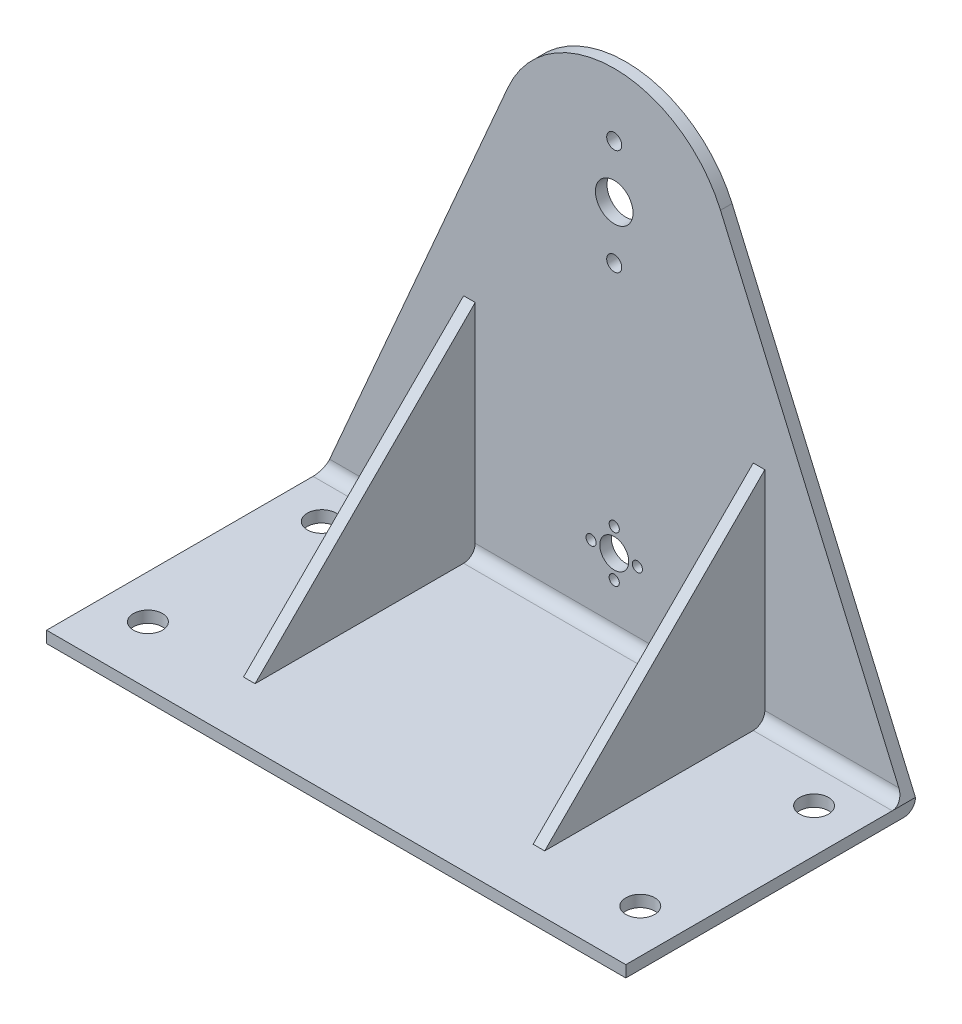
ISO-10303-21;
HEADER;
FILE_DESCRIPTION(('STEP AP214'),'2;1');
FILE_NAME('part.step','',(''),(''),'','','');
FILE_SCHEMA(('AUTOMOTIVE_DESIGN { 1 0 10303 214 1 1 1 1 }'));
ENDSEC;
DATA;
#1=APPLICATION_CONTEXT('core data for automotive mechanical design processes');
#2=APPLICATION_PROTOCOL_DEFINITION('international standard','automotive_design',2000,#1);
#3=PRODUCT_CONTEXT('',#1,'mechanical');
#4=PRODUCT('Part','Part','',(#3));
#5=PRODUCT_RELATED_PRODUCT_CATEGORY('part','',(#4));
#6=PRODUCT_DEFINITION_FORMATION('','',#4);
#7=PRODUCT_DEFINITION_CONTEXT('part definition',#1,'design');
#8=PRODUCT_DEFINITION('design','',#6,#7);
#9=PRODUCT_DEFINITION_SHAPE('','',#8);
#10=(LENGTH_UNIT() NAMED_UNIT(*) SI_UNIT(.MILLI.,.METRE.));
#11=(NAMED_UNIT(*) PLANE_ANGLE_UNIT() SI_UNIT($,.RADIAN.));
#12=(NAMED_UNIT(*) SI_UNIT($,.STERADIAN.) SOLID_ANGLE_UNIT());
#13=UNCERTAINTY_MEASURE_WITH_UNIT(LENGTH_MEASURE(1.E-05),#10,'distance_accuracy_value','');
#14=(GEOMETRIC_REPRESENTATION_CONTEXT(3) GLOBAL_UNCERTAINTY_ASSIGNED_CONTEXT((#13)) GLOBAL_UNIT_ASSIGNED_CONTEXT((#10,
#11,#12)) REPRESENTATION_CONTEXT('',''));
#15=CARTESIAN_POINT('',(0.,0.,0.));
#16=DIRECTION('',(0.,0.,1.));
#17=DIRECTION('',(1.,0.,0.));
#18=AXIS2_PLACEMENT_3D('',#15,#16,#17);
#19=CARTESIAN_POINT('',(100.,4.,8.00000000000001));
#20=DIRECTION('',(1.,0.,0.));
#21=DIRECTION('',(0.,0.,-1.));
#22=AXIS2_PLACEMENT_3D('',#19,#20,#21);
#23=CYLINDRICAL_SURFACE('',#22,4.);
#24=CARTESIAN_POINT('',(48.,4.,8.00000000000001));
#25=DIRECTION('',(1.,0.,0.));
#26=DIRECTION('',(0.,0.,-1.));
#27=AXIS2_PLACEMENT_3D('',#24,#25,#26);
#28=CIRCLE('',#27,4.);
#29=CARTESIAN_POINT('',(48.,4.,4.00000000000001));
#30=VERTEX_POINT('',#29);
#31=CARTESIAN_POINT('',(48.,0.,8.00000000000001));
#32=VERTEX_POINT('',#31);
#33=EDGE_CURVE('E59',#30,#32,#28,.F.);
#34=ORIENTED_EDGE('',*,*,#33,.F.);
#35=DIRECTION('',(-1.,0.,0.));
#36=VECTOR('',#35,1.);
#37=CARTESIAN_POINT('',(100.,4.,4.));
#38=LINE('',#37,#36);
#39=CARTESIAN_POINT('',(-48.,3.99999999999999,4.00000000000001));
#40=VERTEX_POINT('',#39);
#41=EDGE_CURVE('E389',#40,#30,#38,.F.);
#42=ORIENTED_EDGE('',*,*,#41,.F.);
#43=CARTESIAN_POINT('',(-48.,4.,8.00000000000001));
#44=DIRECTION('',(-1.,0.,0.));
#45=DIRECTION('',(0.,0.,1.));
#46=AXIS2_PLACEMENT_3D('',#43,#44,#45);
#47=CIRCLE('',#46,4.);
#48=CARTESIAN_POINT('',(-48.,0.,8.00000000000001));
#49=VERTEX_POINT('',#48);
#50=EDGE_CURVE('E396',#49,#40,#47,.F.);
#51=ORIENTED_EDGE('',*,*,#50,.F.);
#52=DIRECTION('',(-1.,0.,0.));
#53=VECTOR('',#52,1.);
#54=CARTESIAN_POINT('',(-100.,0.,8.00000000000001));
#55=LINE('',#54,#53);
#56=EDGE_CURVE('E384',#32,#49,#55,.T.);
#57=ORIENTED_EDGE('',*,*,#56,.F.);
#58=EDGE_LOOP('',(#34,#42,#51,#57));
#59=FACE_BOUND('',#58,.T.);
#60=ADVANCED_FACE('F43',(#59),#23,.F.);
#61=CARTESIAN_POINT('',(52.,4.,4.00000000000001));
#62=VERTEX_POINT('',#61);
#63=CARTESIAN_POINT('',(98.2646769903882,3.99999999999999,4.));
#64=VERTEX_POINT('',#63);
#65=EDGE_CURVE('E383',#62,#64,#38,.F.);
#66=ORIENTED_EDGE('',*,*,#65,.F.);
#67=CARTESIAN_POINT('',(52.,4.,8.00000000000001));
#68=DIRECTION('',(1.,0.,0.));
#69=DIRECTION('',(0.,0.,-1.));
#70=AXIS2_PLACEMENT_3D('',#67,#68,#69);
#71=CIRCLE('',#70,4.);
#72=CARTESIAN_POINT('',(52.,0.,8.00000000000001));
#73=VERTEX_POINT('',#72);
#74=EDGE_CURVE('E185',#62,#73,#71,.F.);
#75=ORIENTED_EDGE('',*,*,#74,.T.);
#76=CARTESIAN_POINT('',(100.,0.,8.00000000000001));
#77=VERTEX_POINT('',#76);
#78=EDGE_CURVE('E181',#77,#73,#55,.T.);
#79=ORIENTED_EDGE('',*,*,#78,.F.);
#80=CARTESIAN_POINT('',(98.2646769903882,4.,8.00000000000001));
#81=DIRECTION('',(-0.917389064563678,-0.397991588125906,0.));
#82=DIRECTION('',(0.397991588125906,-0.917389064563678,0.));
#83=AXIS2_PLACEMENT_3D('',#80,#81,#82);
#84=ELLIPSE('',#83,4.36020021876155,4.);
#85=EDGE_CURVE('E392',#64,#77,#84,.T.);
#86=ORIENTED_EDGE('',*,*,#85,.F.);
#87=EDGE_LOOP('',(#66,#75,#79,#86));
#88=FACE_BOUND('',#87,.T.);
#89=ADVANCED_FACE('F456',(#88),#23,.F.);
#90=CARTESIAN_POINT('',(0.,130.,4.));
#91=DIRECTION('',(0.,0.,-1.));
#92=DIRECTION('',(-1.,0.,0.));
#93=AXIS2_PLACEMENT_3D('',#90,#91,#92);
#94=CYLINDRICAL_SURFACE('',#93,40.);
#95=CARTESIAN_POINT('',(0.,130.,0.));
#96=DIRECTION('',(0.,0.,1.));
#97=DIRECTION('',(1.,0.,0.));
#98=AXIS2_PLACEMENT_3D('',#95,#96,#97);
#99=CIRCLE('',#98,40.);
#100=CARTESIAN_POINT('',(36.6955625825471,145.919663525036,0.));
#101=VERTEX_POINT('',#100);
#102=CARTESIAN_POINT('',(-36.6955625825471,145.919663525036,0.));
#103=VERTEX_POINT('',#102);
#104=EDGE_CURVE('E337',#101,#103,#99,.T.);
#105=ORIENTED_EDGE('',*,*,#104,.T.);
#106=DIRECTION('',(0.,0.,-1.));
#107=VECTOR('',#106,1.);
#108=CARTESIAN_POINT('',(-36.6955625825471,145.919663525036,4.));
#109=LINE('',#108,#107);
#110=CARTESIAN_POINT('',(-36.6955625825471,145.919663525036,4.));
#111=VERTEX_POINT('',#110);
#112=EDGE_CURVE('E359',#111,#103,#109,.T.);
#113=ORIENTED_EDGE('',*,*,#112,.F.);
#114=CARTESIAN_POINT('',(0.,130.,4.));
#115=DIRECTION('',(0.,0.,1.));
#116=DIRECTION('',(1.,0.,0.));
#117=AXIS2_PLACEMENT_3D('',#114,#115,#116);
#118=CIRCLE('',#117,40.);
#119=CARTESIAN_POINT('',(36.6955625825471,145.919663525036,4.));
#120=VERTEX_POINT('',#119);
#121=EDGE_CURVE('E321',#120,#111,#118,.T.);
#122=ORIENTED_EDGE('',*,*,#121,.F.);
#123=DIRECTION('',(0.,0.,-1.));
#124=VECTOR('',#123,1.);
#125=CARTESIAN_POINT('',(36.6955625825471,145.919663525036,4.));
#126=LINE('',#125,#124);
#127=EDGE_CURVE('E332',#120,#101,#126,.T.);
#128=ORIENTED_EDGE('',*,*,#127,.T.);
#129=EDGE_LOOP('',(#105,#113,#122,#128));
#130=FACE_BOUND('',#129,.T.);
#131=ADVANCED_FACE('F472',(#130),#94,.T.);
#132=CARTESIAN_POINT('',(-84.1602695781019,36.5113130735037,4.));
#133=DIRECTION('',(-0.917389064563678,0.397991588125906,0.));
#134=DIRECTION('',(-0.397991588125906,-0.917389064563678,0.));
#135=AXIS2_PLACEMENT_3D('',#132,#133,#134);
#136=PLANE('',#135);
#137=DIRECTION('',(0.397991588125906,0.917389064563678,0.));
#138=VECTOR('',#137,1.);
#139=CARTESIAN_POINT('',(-84.1602695781019,36.5113130735037,0.));
#140=LINE('',#139,#138);
#141=CARTESIAN_POINT('',(-100.,0.,0.));
#142=VERTEX_POINT('',#141);
#143=EDGE_CURVE('E342',#142,#103,#140,.T.);
#144=ORIENTED_EDGE('',*,*,#143,.F.);
#145=DIRECTION('',(0.,0.,-1.));
#146=VECTOR('',#145,1.);
#147=CARTESIAN_POINT('',(-100.,0.,4.));
#148=LINE('',#147,#146);
#149=CARTESIAN_POINT('',(-100.,0.,8.00000000000001));
#150=VERTEX_POINT('',#149);
#151=EDGE_CURVE('E355',#150,#142,#148,.T.);
#152=ORIENTED_EDGE('',*,*,#151,.F.);
#153=CARTESIAN_POINT('',(-98.2646769903882,4.,8.00000000000001));
#154=DIRECTION('',(-0.917389064563678,0.397991588125906,0.));
#155=DIRECTION('',(0.397991588125906,0.917389064563678,0.));
#156=AXIS2_PLACEMENT_3D('',#153,#154,#155);
#157=ELLIPSE('',#156,4.36020021876155,4.);
#158=CARTESIAN_POINT('',(-98.2646769903882,3.99999999999999,4.));
#159=VERTEX_POINT('',#158);
#160=EDGE_CURVE('E388',#150,#159,#157,.F.);
#161=ORIENTED_EDGE('',*,*,#160,.T.);
#162=DIRECTION('',(0.397991588125906,0.917389064563678,0.));
#163=VECTOR('',#162,1.);
#164=CARTESIAN_POINT('',(-84.1602695781019,36.5113130735037,4.));
#165=LINE('',#164,#163);
#166=EDGE_CURVE('E326',#159,#111,#165,.T.);
#167=ORIENTED_EDGE('',*,*,#166,.T.);
#168=ORIENTED_EDGE('',*,*,#112,.T.);
#169=EDGE_LOOP('',(#144,#152,#161,#167,#168));
#170=FACE_BOUND('',#169,.T.);
#171=ADVANCED_FACE('F507',(#170),#136,.T.);
#172=CARTESIAN_POINT('',(0.,130.,4.));
#173=DIRECTION('',(0.,0.,-1.));
#174=DIRECTION('',(-1.,0.,0.));
#175=AXIS2_PLACEMENT_3D('',#172,#173,#174);
#176=CYLINDRICAL_SURFACE('',#175,6.50000000000001);
#177=CARTESIAN_POINT('',(0.,130.,4.));
#178=DIRECTION('',(0.,0.,1.));
#179=DIRECTION('',(1.,0.,0.));
#180=AXIS2_PLACEMENT_3D('',#177,#178,#179);
#181=CIRCLE('',#180,6.50000000000001);
#182=CARTESIAN_POINT('',(6.50000000000001,130.,4.));
#183=VERTEX_POINT('',#182);
#184=EDGE_CURVE('E317',#183,#183,#181,.T.);
#185=ORIENTED_EDGE('',*,*,#184,.T.);
#186=EDGE_LOOP('',(#185));
#187=FACE_BOUND('',#186,.T.);
#188=CARTESIAN_POINT('',(0.,130.,0.));
#189=DIRECTION('',(0.,0.,1.));
#190=DIRECTION('',(1.,0.,0.));
#191=AXIS2_PLACEMENT_3D('',#188,#189,#190);
#192=CIRCLE('',#191,6.50000000000001);
#193=CARTESIAN_POINT('',(6.50000000000001,130.,0.));
#194=VERTEX_POINT('',#193);
#195=EDGE_CURVE('E333',#194,#194,#192,.T.);
#196=ORIENTED_EDGE('',*,*,#195,.F.);
#197=EDGE_LOOP('',(#196));
#198=FACE_BOUND('',#197,.T.);
#199=ADVANCED_FACE('F504',(#187,#198),#176,.F.);
#200=CARTESIAN_POINT('',(84.1602695781019,36.5113130735037,4.));
#201=DIRECTION('',(-0.917389064563678,-0.397991588125906,0.));
#202=DIRECTION('',(0.397991588125906,-0.917389064563678,0.));
#203=AXIS2_PLACEMENT_3D('',#200,#201,#202);
#204=PLANE('',#203);
#205=DIRECTION('',(-0.397991588125906,0.917389064563678,0.));
#206=VECTOR('',#205,1.);
#207=CARTESIAN_POINT('',(84.1602695781019,36.5113130735037,0.));
#208=LINE('',#207,#206);
#209=CARTESIAN_POINT('',(100.,0.,0.));
#210=VERTEX_POINT('',#209);
#211=EDGE_CURVE('E322',#210,#101,#208,.T.);
#212=ORIENTED_EDGE('',*,*,#211,.T.);
#213=ORIENTED_EDGE('',*,*,#127,.F.);
#214=DIRECTION('',(-0.397991588125906,0.917389064563678,0.));
#215=VECTOR('',#214,1.);
#216=CARTESIAN_POINT('',(84.1602695781019,36.5113130735037,4.));
#217=LINE('',#216,#215);
#218=EDGE_CURVE('E329',#64,#120,#217,.T.);
#219=ORIENTED_EDGE('',*,*,#218,.F.);
#220=ORIENTED_EDGE('',*,*,#85,.T.);
#221=DIRECTION('',(0.,0.,-1.));
#222=VECTOR('',#221,1.);
#223=CARTESIAN_POINT('',(100.,0.,4.));
#224=LINE('',#223,#222);
#225=EDGE_CURVE('E351',#77,#210,#224,.T.);
#226=ORIENTED_EDGE('',*,*,#225,.T.);
#227=EDGE_LOOP('',(#212,#213,#219,#220,#226));
#228=FACE_BOUND('',#227,.T.);
#229=ADVANCED_FACE('F454',(#228),#204,.F.);
#230=CARTESIAN_POINT('',(0.,0.,4.));
#231=DIRECTION('',(0.,0.,1.));
#232=DIRECTION('',(1.,0.,0.));
#233=AXIS2_PLACEMENT_3D('',#230,#231,#232);
#234=PLANE('',#233);
#235=DIRECTION('',(0.,1.,0.));
#236=VECTOR('',#235,1.);
#237=CARTESIAN_POINT('',(52.,0.,4.));
#238=LINE('',#237,#236);
#239=CARTESIAN_POINT('',(52.,76.,4.00000000000001));
#240=VERTEX_POINT('',#239);
#241=EDGE_CURVE('E190',#62,#240,#238,.T.);
#242=ORIENTED_EDGE('',*,*,#241,.F.);
#243=ORIENTED_EDGE('',*,*,#65,.T.);
#244=ORIENTED_EDGE('',*,*,#218,.T.);
#245=ORIENTED_EDGE('',*,*,#121,.T.);
#246=ORIENTED_EDGE('',*,*,#166,.F.);
#247=CARTESIAN_POINT('',(-52.,4.,4.));
#248=VERTEX_POINT('',#247);
#249=EDGE_CURVE('E385',#159,#248,#38,.F.);
#250=ORIENTED_EDGE('',*,*,#249,.T.);
#251=DIRECTION('',(0.,-1.,0.));
#252=VECTOR('',#251,1.);
#253=CARTESIAN_POINT('',(-52.,0.,4.));
#254=LINE('',#253,#252);
#255=CARTESIAN_POINT('',(-52.,76.,4.));
#256=VERTEX_POINT('',#255);
#257=EDGE_CURVE('E67',#256,#248,#254,.T.);
#258=ORIENTED_EDGE('',*,*,#257,.F.);
#259=DIRECTION('',(-1.,0.,0.));
#260=VECTOR('',#259,1.);
#261=CARTESIAN_POINT('',(0.,76.,4.));
#262=LINE('',#261,#260);
#263=CARTESIAN_POINT('',(-48.,76.,4.00000000000001));
#264=VERTEX_POINT('',#263);
#265=EDGE_CURVE('E220',#264,#256,#262,.T.);
#266=ORIENTED_EDGE('',*,*,#265,.F.);
#267=DIRECTION('',(0.,-1.,0.));
#268=VECTOR('',#267,1.);
#269=CARTESIAN_POINT('',(-48.,0.,4.));
#270=LINE('',#269,#268);
#271=EDGE_CURVE('E210',#264,#40,#270,.T.);
#272=ORIENTED_EDGE('',*,*,#271,.T.);
#273=ORIENTED_EDGE('',*,*,#41,.T.);
#274=DIRECTION('',(0.,1.,0.));
#275=VECTOR('',#274,1.);
#276=CARTESIAN_POINT('',(48.,0.,4.));
#277=LINE('',#276,#275);
#278=CARTESIAN_POINT('',(48.,76.,4.00000000000001));
#279=VERTEX_POINT('',#278);
#280=EDGE_CURVE('E186',#30,#279,#277,.T.);
#281=ORIENTED_EDGE('',*,*,#280,.T.);
#282=DIRECTION('',(1.,0.,0.));
#283=VECTOR('',#282,1.);
#284=CARTESIAN_POINT('',(0.,76.,4.));
#285=LINE('',#284,#283);
#286=EDGE_CURVE('E171',#240,#279,#285,.F.);
#287=ORIENTED_EDGE('',*,*,#286,.F.);
#288=EDGE_LOOP('',(#242,#243,#244,#245,#246,#250,#258,#266,#272,#273,#281,#287));
#289=FACE_BOUND('',#288,.T.);
#290=CARTESIAN_POINT('',(0.,33.,4.));
#291=DIRECTION('',(0.,0.,1.));
#292=DIRECTION('',(1.,0.,0.));
#293=AXIS2_PLACEMENT_3D('',#290,#291,#292);
#294=CIRCLE('',#293,1.75);
#295=CARTESIAN_POINT('',(1.75,33.,4.));
#296=VERTEX_POINT('',#295);
#297=EDGE_CURVE('E232',#296,#296,#294,.T.);
#298=ORIENTED_EDGE('',*,*,#297,.F.);
#299=EDGE_LOOP('',(#298));
#300=FACE_BOUND('',#299,.T.);
#301=CARTESIAN_POINT('',(0.,17.,4.));
#302=DIRECTION('',(0.,0.,1.));
#303=DIRECTION('',(1.,0.,0.));
#304=AXIS2_PLACEMENT_3D('',#301,#302,#303);
#305=CIRCLE('',#304,1.75);
#306=CARTESIAN_POINT('',(1.75,17.,4.));
#307=VERTEX_POINT('',#306);
#308=EDGE_CURVE('E228',#307,#307,#305,.T.);
#309=ORIENTED_EDGE('',*,*,#308,.F.);
#310=EDGE_LOOP('',(#309));
#311=FACE_BOUND('',#310,.T.);
#312=CARTESIAN_POINT('',(8.,25.,4.));
#313=DIRECTION('',(0.,0.,1.));
#314=DIRECTION('',(1.,0.,0.));
#315=AXIS2_PLACEMENT_3D('',#312,#313,#314);
#316=CIRCLE('',#315,1.75);
#317=CARTESIAN_POINT('',(9.75,25.,4.));
#318=VERTEX_POINT('',#317);
#319=EDGE_CURVE('E224',#318,#318,#316,.T.);
#320=ORIENTED_EDGE('',*,*,#319,.F.);
#321=EDGE_LOOP('',(#320));
#322=FACE_BOUND('',#321,.T.);
#323=CARTESIAN_POINT('',(-8.,25.,4.));
#324=DIRECTION('',(0.,0.,1.));
#325=DIRECTION('',(1.,0.,0.));
#326=AXIS2_PLACEMENT_3D('',#323,#324,#325);
#327=CIRCLE('',#326,1.75);
#328=CARTESIAN_POINT('',(-6.25,25.,4.));
#329=VERTEX_POINT('',#328);
#330=EDGE_CURVE('E223',#329,#329,#327,.T.);
#331=ORIENTED_EDGE('',*,*,#330,.F.);
#332=EDGE_LOOP('',(#331));
#333=FACE_BOUND('',#332,.T.);
#334=CARTESIAN_POINT('',(0.,25.,4.));
#335=DIRECTION('',(0.,0.,1.));
#336=DIRECTION('',(1.,0.,0.));
#337=AXIS2_PLACEMENT_3D('',#334,#335,#336);
#338=CIRCLE('',#337,5.);
#339=CARTESIAN_POINT('',(5.,25.,4.));
#340=VERTEX_POINT('',#339);
#341=EDGE_CURVE('E236',#340,#340,#338,.T.);
#342=ORIENTED_EDGE('',*,*,#341,.F.);
#343=EDGE_LOOP('',(#342));
#344=FACE_BOUND('',#343,.T.);
#345=CARTESIAN_POINT('',(0.,111.75,4.));
#346=DIRECTION('',(0.,0.,1.));
#347=DIRECTION('',(1.,0.,0.));
#348=AXIS2_PLACEMENT_3D('',#345,#346,#347);
#349=CIRCLE('',#348,2.6);
#350=CARTESIAN_POINT('',(2.6,111.75,4.));
#351=VERTEX_POINT('',#350);
#352=EDGE_CURVE('E312',#351,#351,#349,.T.);
#353=ORIENTED_EDGE('',*,*,#352,.F.);
#354=EDGE_LOOP('',(#353));
#355=FACE_BOUND('',#354,.T.);
#356=CARTESIAN_POINT('',(0.,148.25,4.));
#357=DIRECTION('',(0.,0.,1.));
#358=DIRECTION('',(1.,0.,0.));
#359=AXIS2_PLACEMENT_3D('',#356,#357,#358);
#360=CIRCLE('',#359,2.59999999999999);
#361=CARTESIAN_POINT('',(2.6,148.25,4.));
#362=VERTEX_POINT('',#361);
#363=EDGE_CURVE('E305',#362,#362,#360,.T.);
#364=ORIENTED_EDGE('',*,*,#363,.F.);
#365=EDGE_LOOP('',(#364));
#366=FACE_BOUND('',#365,.T.);
#367=ORIENTED_EDGE('',*,*,#184,.F.);
#368=EDGE_LOOP('',(#367));
#369=FACE_BOUND('',#368,.T.);
#370=ADVANCED_FACE('F433',(#289,#300,#311,#322,#333,#344,#355,#366,#369),#234,.T.);
#371=CARTESIAN_POINT('',(0.,0.,0.));
#372=DIRECTION('',(0.,0.,1.));
#373=DIRECTION('',(1.,0.,0.));
#374=AXIS2_PLACEMENT_3D('',#371,#372,#373);
#375=PLANE('',#374);
#376=DIRECTION('',(-1.,0.,0.));
#377=VECTOR('',#376,1.);
#378=CARTESIAN_POINT('',(-100.,0.,0.));
#379=LINE('',#378,#377);
#380=EDGE_CURVE('E362',#210,#142,#379,.T.);
#381=ORIENTED_EDGE('',*,*,#380,.T.);
#382=ORIENTED_EDGE('',*,*,#143,.T.);
#383=ORIENTED_EDGE('',*,*,#104,.F.);
#384=ORIENTED_EDGE('',*,*,#211,.F.);
#385=EDGE_LOOP('',(#381,#382,#383,#384));
#386=FACE_BOUND('',#385,.T.);
#387=CARTESIAN_POINT('',(0.,33.,0.));
#388=DIRECTION('',(0.,0.,1.));
#389=DIRECTION('',(1.,0.,0.));
#390=AXIS2_PLACEMENT_3D('',#387,#388,#389);
#391=CIRCLE('',#390,1.75);
#392=CARTESIAN_POINT('',(1.75,33.,0.));
#393=VERTEX_POINT('',#392);
#394=EDGE_CURVE('E249',#393,#393,#391,.T.);
#395=ORIENTED_EDGE('',*,*,#394,.T.);
#396=EDGE_LOOP('',(#395));
#397=FACE_BOUND('',#396,.T.);
#398=CARTESIAN_POINT('',(0.,17.,0.));
#399=DIRECTION('',(0.,0.,1.));
#400=DIRECTION('',(1.,0.,0.));
#401=AXIS2_PLACEMENT_3D('',#398,#399,#400);
#402=CIRCLE('',#401,1.75);
#403=CARTESIAN_POINT('',(1.75,17.,0.));
#404=VERTEX_POINT('',#403);
#405=EDGE_CURVE('E408',#404,#404,#402,.T.);
#406=ORIENTED_EDGE('',*,*,#405,.T.);
#407=EDGE_LOOP('',(#406));
#408=FACE_BOUND('',#407,.T.);
#409=CARTESIAN_POINT('',(8.,25.,0.));
#410=DIRECTION('',(0.,0.,1.));
#411=DIRECTION('',(1.,0.,0.));
#412=AXIS2_PLACEMENT_3D('',#409,#410,#411);
#413=CIRCLE('',#412,1.75);
#414=CARTESIAN_POINT('',(9.75,25.,0.));
#415=VERTEX_POINT('',#414);
#416=EDGE_CURVE('E404',#415,#415,#413,.T.);
#417=ORIENTED_EDGE('',*,*,#416,.T.);
#418=EDGE_LOOP('',(#417));
#419=FACE_BOUND('',#418,.T.);
#420=CARTESIAN_POINT('',(-8.,25.,0.));
#421=DIRECTION('',(0.,0.,1.));
#422=DIRECTION('',(1.,0.,0.));
#423=AXIS2_PLACEMENT_3D('',#420,#421,#422);
#424=CIRCLE('',#423,1.75);
#425=CARTESIAN_POINT('',(-6.25,25.,0.));
#426=VERTEX_POINT('',#425);
#427=EDGE_CURVE('E400',#426,#426,#424,.T.);
#428=ORIENTED_EDGE('',*,*,#427,.T.);
#429=EDGE_LOOP('',(#428));
#430=FACE_BOUND('',#429,.T.);
#431=CARTESIAN_POINT('',(0.,25.,0.));
#432=DIRECTION('',(0.,0.,1.));
#433=DIRECTION('',(1.,0.,0.));
#434=AXIS2_PLACEMENT_3D('',#431,#432,#433);
#435=CIRCLE('',#434,5.);
#436=CARTESIAN_POINT('',(5.,25.,0.));
#437=VERTEX_POINT('',#436);
#438=EDGE_CURVE('E243',#437,#437,#435,.T.);
#439=ORIENTED_EDGE('',*,*,#438,.T.);
#440=EDGE_LOOP('',(#439));
#441=FACE_BOUND('',#440,.T.);
#442=CARTESIAN_POINT('',(0.,111.75,0.));
#443=DIRECTION('',(0.,0.,-1.));
#444=DIRECTION('',(-1.,0.,0.));
#445=AXIS2_PLACEMENT_3D('',#442,#443,#444);
#446=CIRCLE('',#445,2.6);
#447=CARTESIAN_POINT('',(-2.6,111.75,0.));
#448=VERTEX_POINT('',#447);
#449=EDGE_CURVE('E301',#448,#448,#446,.T.);
#450=ORIENTED_EDGE('',*,*,#449,.F.);
#451=EDGE_LOOP('',(#450));
#452=FACE_BOUND('',#451,.T.);
#453=CARTESIAN_POINT('',(0.,148.25,0.));
#454=DIRECTION('',(0.,0.,-1.));
#455=DIRECTION('',(-1.,0.,0.));
#456=AXIS2_PLACEMENT_3D('',#453,#454,#455);
#457=CIRCLE('',#456,2.59999999999999);
#458=CARTESIAN_POINT('',(-2.59999999999999,148.25,0.));
#459=VERTEX_POINT('',#458);
#460=EDGE_CURVE('E297',#459,#459,#457,.T.);
#461=ORIENTED_EDGE('',*,*,#460,.F.);
#462=EDGE_LOOP('',(#461));
#463=FACE_BOUND('',#462,.T.);
#464=ORIENTED_EDGE('',*,*,#195,.T.);
#465=EDGE_LOOP('',(#464));
#466=FACE_BOUND('',#465,.T.);
#467=ADVANCED_FACE('F502',(#386,#397,#408,#419,#430,#441,#452,#463,#466),#375,.F.);
#468=CARTESIAN_POINT('',(100.,0.,4.));
#469=DIRECTION('',(1.,0.,0.));
#470=DIRECTION('',(0.,0.,-1.));
#471=AXIS2_PLACEMENT_3D('',#468,#469,#470);
#472=PLANE('',#471);
#473=DIRECTION('',(0.,0.,-1.));
#474=VECTOR('',#473,1.);
#475=CARTESIAN_POINT('',(100.,-3.99999999999996,4.));
#476=LINE('',#475,#474);
#477=CARTESIAN_POINT('',(100.,-3.99999999999996,100.));
#478=VERTEX_POINT('',#477);
#479=CARTESIAN_POINT('',(100.,-3.99999999999996,4.));
#480=VERTEX_POINT('',#479);
#481=EDGE_CURVE('E338',#478,#480,#476,.T.);
#482=ORIENTED_EDGE('',*,*,#481,.T.);
#483=CARTESIAN_POINT('',(100.,0.,4.));
#484=DIRECTION('',(1.,0.,0.));
#485=DIRECTION('',(0.,0.,-1.));
#486=AXIS2_PLACEMENT_3D('',#483,#484,#485);
#487=CIRCLE('',#486,4.);
#488=EDGE_CURVE('E377',#480,#210,#487,.T.);
#489=ORIENTED_EDGE('',*,*,#488,.T.);
#490=ORIENTED_EDGE('',*,*,#225,.F.);
#491=DIRECTION('',(0.,0.,-1.));
#492=VECTOR('',#491,1.);
#493=CARTESIAN_POINT('',(100.,0.,100.));
#494=LINE('',#493,#492);
#495=CARTESIAN_POINT('',(100.,0.,100.));
#496=VERTEX_POINT('',#495);
#497=EDGE_CURVE('E294',#496,#77,#494,.T.);
#498=ORIENTED_EDGE('',*,*,#497,.F.);
#499=DIRECTION('',(0.,-1.,0.));
#500=VECTOR('',#499,1.);
#501=CARTESIAN_POINT('',(100.,0.,100.));
#502=LINE('',#501,#500);
#503=EDGE_CURVE('E277',#496,#478,#502,.T.);
#504=ORIENTED_EDGE('',*,*,#503,.T.);
#505=EDGE_LOOP('',(#482,#489,#490,#498,#504));
#506=FACE_BOUND('',#505,.T.);
#507=ADVANCED_FACE('F494',(#506),#472,.T.);
#508=CARTESIAN_POINT('',(100.,-3.99999999999996,4.));
#509=DIRECTION('',(0.,-1.,0.));
#510=DIRECTION('',(1.,0.,0.));
#511=AXIS2_PLACEMENT_3D('',#508,#509,#510);
#512=PLANE('',#511);
#513=DIRECTION('',(-1.,0.,0.));
#514=VECTOR('',#513,1.);
#515=CARTESIAN_POINT('',(100.,-3.99999999999996,4.));
#516=LINE('',#515,#514);
#517=CARTESIAN_POINT('',(-100.,-4.00000000000002,4.));
#518=VERTEX_POINT('',#517);
#519=EDGE_CURVE('E374',#518,#480,#516,.F.);
#520=ORIENTED_EDGE('',*,*,#519,.T.);
#521=ORIENTED_EDGE('',*,*,#481,.F.);
#522=DIRECTION('',(-1.,0.,0.));
#523=VECTOR('',#522,1.);
#524=CARTESIAN_POINT('',(100.,-3.99999999999996,100.));
#525=LINE('',#524,#523);
#526=CARTESIAN_POINT('',(-100.,-4.00000000000002,100.));
#527=VERTEX_POINT('',#526);
#528=EDGE_CURVE('E281',#478,#527,#525,.T.);
#529=ORIENTED_EDGE('',*,*,#528,.T.);
#530=DIRECTION('',(0.,0.,-1.));
#531=VECTOR('',#530,1.);
#532=CARTESIAN_POINT('',(-100.,-4.00000000000002,4.));
#533=LINE('',#532,#531);
#534=EDGE_CURVE('E316',#527,#518,#533,.T.);
#535=ORIENTED_EDGE('',*,*,#534,.T.);
#536=EDGE_LOOP('',(#520,#521,#529,#535));
#537=FACE_BOUND('',#536,.T.);
#538=CARTESIAN_POINT('',(-85.,-4.00000000000002,20.));
#539=DIRECTION('',(0.,-1.,0.));
#540=DIRECTION('',(1.,0.,0.));
#541=AXIS2_PLACEMENT_3D('',#538,#539,#540);
#542=CIRCLE('',#541,5.);
#543=CARTESIAN_POINT('',(-80.,-4.00000000000002,20.));
#544=VERTEX_POINT('',#543);
#545=EDGE_CURVE('E273',#544,#544,#542,.T.);
#546=ORIENTED_EDGE('',*,*,#545,.F.);
#547=EDGE_LOOP('',(#546));
#548=FACE_BOUND('',#547,.T.);
#549=CARTESIAN_POINT('',(85.,-3.99999999999996,80.));
#550=DIRECTION('',(0.,-1.,0.));
#551=DIRECTION('',(1.,0.,0.));
#552=AXIS2_PLACEMENT_3D('',#549,#550,#551);
#553=CIRCLE('',#552,5.00000000000001);
#554=CARTESIAN_POINT('',(90.,-3.99999999999996,80.));
#555=VERTEX_POINT('',#554);
#556=EDGE_CURVE('E269',#555,#555,#553,.T.);
#557=ORIENTED_EDGE('',*,*,#556,.F.);
#558=EDGE_LOOP('',(#557));
#559=FACE_BOUND('',#558,.T.);
#560=CARTESIAN_POINT('',(85.,-3.99999999999996,20.));
#561=DIRECTION('',(0.,-1.,0.));
#562=DIRECTION('',(1.,0.,0.));
#563=AXIS2_PLACEMENT_3D('',#560,#561,#562);
#564=CIRCLE('',#563,5.);
#565=CARTESIAN_POINT('',(90.,-3.99999999999996,20.));
#566=VERTEX_POINT('',#565);
#567=EDGE_CURVE('E265',#566,#566,#564,.T.);
#568=ORIENTED_EDGE('',*,*,#567,.F.);
#569=EDGE_LOOP('',(#568));
#570=FACE_BOUND('',#569,.T.);
#571=CARTESIAN_POINT('',(-85.,-4.00000000000002,80.));
#572=DIRECTION('',(0.,-1.,0.));
#573=DIRECTION('',(1.,0.,0.));
#574=AXIS2_PLACEMENT_3D('',#571,#572,#573);
#575=CIRCLE('',#574,5.00000000000001);
#576=CARTESIAN_POINT('',(-80.,-4.00000000000002,80.));
#577=VERTEX_POINT('',#576);
#578=EDGE_CURVE('E261',#577,#577,#575,.T.);
#579=ORIENTED_EDGE('',*,*,#578,.F.);
#580=EDGE_LOOP('',(#579));
#581=FACE_BOUND('',#580,.T.);
#582=ADVANCED_FACE('F473',(#537,#548,#559,#570,#581),#512,.T.);
#583=CARTESIAN_POINT('',(-100.,0.,4.));
#584=DIRECTION('',(1.,0.,0.));
#585=DIRECTION('',(0.,0.,-1.));
#586=AXIS2_PLACEMENT_3D('',#583,#584,#585);
#587=PLANE('',#586);
#588=ORIENTED_EDGE('',*,*,#151,.T.);
#589=CARTESIAN_POINT('',(-100.,0.,4.));
#590=DIRECTION('',(1.,0.,0.));
#591=DIRECTION('',(0.,0.,-1.));
#592=AXIS2_PLACEMENT_3D('',#589,#590,#591);
#593=CIRCLE('',#592,4.);
#594=EDGE_CURVE('E371',#142,#518,#593,.F.);
#595=ORIENTED_EDGE('',*,*,#594,.T.);
#596=ORIENTED_EDGE('',*,*,#534,.F.);
#597=DIRECTION('',(0.,1.,0.));
#598=VECTOR('',#597,1.);
#599=CARTESIAN_POINT('',(-100.,0.,100.));
#600=LINE('',#599,#598);
#601=CARTESIAN_POINT('',(-100.,0.,100.));
#602=VERTEX_POINT('',#601);
#603=EDGE_CURVE('E285',#527,#602,#600,.T.);
#604=ORIENTED_EDGE('',*,*,#603,.T.);
#605=DIRECTION('',(0.,0.,-1.));
#606=VECTOR('',#605,1.);
#607=CARTESIAN_POINT('',(-100.,0.,100.));
#608=LINE('',#607,#606);
#609=EDGE_CURVE('E293',#602,#150,#608,.T.);
#610=ORIENTED_EDGE('',*,*,#609,.T.);
#611=EDGE_LOOP('',(#588,#595,#596,#604,#610));
#612=FACE_BOUND('',#611,.T.);
#613=ADVANCED_FACE('F493',(#612),#587,.F.);
#614=CARTESIAN_POINT('',(0.,148.25,10.));
#615=DIRECTION('',(0.,0.,-1.));
#616=DIRECTION('',(-1.,0.,0.));
#617=AXIS2_PLACEMENT_3D('',#614,#615,#616);
#618=CYLINDRICAL_SURFACE('',#617,2.59999999999999);
#619=ORIENTED_EDGE('',*,*,#363,.T.);
#620=EDGE_LOOP('',(#619));
#621=FACE_BOUND('',#620,.T.);
#622=ORIENTED_EDGE('',*,*,#460,.T.);
#623=EDGE_LOOP('',(#622));
#624=FACE_BOUND('',#623,.T.);
#625=ADVANCED_FACE('F498',(#621,#624),#618,.F.);
#626=CARTESIAN_POINT('',(0.,111.75,10.));
#627=DIRECTION('',(0.,0.,-1.));
#628=DIRECTION('',(-1.,0.,0.));
#629=AXIS2_PLACEMENT_3D('',#626,#627,#628);
#630=CYLINDRICAL_SURFACE('',#629,2.6);
#631=ORIENTED_EDGE('',*,*,#352,.T.);
#632=EDGE_LOOP('',(#631));
#633=FACE_BOUND('',#632,.T.);
#634=ORIENTED_EDGE('',*,*,#449,.T.);
#635=EDGE_LOOP('',(#634));
#636=FACE_BOUND('',#635,.T.);
#637=ADVANCED_FACE('F524',(#633,#636),#630,.F.);
#638=CARTESIAN_POINT('',(100.,0.,100.));
#639=DIRECTION('',(0.,1.,0.));
#640=DIRECTION('',(0.,0.,1.));
#641=AXIS2_PLACEMENT_3D('',#638,#639,#640);
#642=PLANE('',#641);
#643=DIRECTION('',(0.,0.,-1.));
#644=VECTOR('',#643,1.);
#645=CARTESIAN_POINT('',(52.,0.,100.));
#646=LINE('',#645,#644);
#647=CARTESIAN_POINT('',(52.,0.,80.));
#648=VERTEX_POINT('',#647);
#649=EDGE_CURVE('E178',#648,#73,#646,.T.);
#650=ORIENTED_EDGE('',*,*,#649,.F.);
#651=DIRECTION('',(-1.,0.,0.));
#652=VECTOR('',#651,1.);
#653=CARTESIAN_POINT('',(100.,0.,80.));
#654=LINE('',#653,#652);
#655=CARTESIAN_POINT('',(48.,0.,80.));
#656=VERTEX_POINT('',#655);
#657=EDGE_CURVE('E11',#656,#648,#654,.F.);
#658=ORIENTED_EDGE('',*,*,#657,.F.);
#659=DIRECTION('',(0.,0.,-1.));
#660=VECTOR('',#659,1.);
#661=CARTESIAN_POINT('',(48.,0.,100.));
#662=LINE('',#661,#660);
#663=EDGE_CURVE('E155',#656,#32,#662,.T.);
#664=ORIENTED_EDGE('',*,*,#663,.T.);
#665=ORIENTED_EDGE('',*,*,#56,.T.);
#666=DIRECTION('',(0.,0.,1.));
#667=VECTOR('',#666,1.);
#668=CARTESIAN_POINT('',(-48.,0.,100.));
#669=LINE('',#668,#667);
#670=CARTESIAN_POINT('',(-48.,0.,80.));
#671=VERTEX_POINT('',#670);
#672=EDGE_CURVE('E204',#49,#671,#669,.T.);
#673=ORIENTED_EDGE('',*,*,#672,.T.);
#674=DIRECTION('',(1.,0.,0.));
#675=VECTOR('',#674,1.);
#676=CARTESIAN_POINT('',(100.,0.,80.));
#677=LINE('',#676,#675);
#678=CARTESIAN_POINT('',(-52.,0.,80.));
#679=VERTEX_POINT('',#678);
#680=EDGE_CURVE('E52',#679,#671,#677,.T.);
#681=ORIENTED_EDGE('',*,*,#680,.F.);
#682=DIRECTION('',(0.,0.,1.));
#683=VECTOR('',#682,1.);
#684=CARTESIAN_POINT('',(-52.,0.,100.));
#685=LINE('',#684,#683);
#686=CARTESIAN_POINT('',(-52.,0.,8.00000000000001));
#687=VERTEX_POINT('',#686);
#688=EDGE_CURVE('E214',#687,#679,#685,.T.);
#689=ORIENTED_EDGE('',*,*,#688,.F.);
#690=EDGE_CURVE('E380',#687,#150,#55,.T.);
#691=ORIENTED_EDGE('',*,*,#690,.T.);
#692=ORIENTED_EDGE('',*,*,#609,.F.);
#693=DIRECTION('',(1.,0.,0.));
#694=VECTOR('',#693,1.);
#695=CARTESIAN_POINT('',(100.,0.,100.));
#696=LINE('',#695,#694);
#697=EDGE_CURVE('E289',#602,#496,#696,.T.);
#698=ORIENTED_EDGE('',*,*,#697,.T.);
#699=ORIENTED_EDGE('',*,*,#497,.T.);
#700=ORIENTED_EDGE('',*,*,#78,.T.);
#701=EDGE_LOOP('',(#650,#658,#664,#665,#673,#681,#689,#691,#692,#698,#699,#700));
#702=FACE_BOUND('',#701,.T.);
#703=CARTESIAN_POINT('',(-85.,0.,20.));
#704=DIRECTION('',(0.,1.,0.));
#705=DIRECTION('',(0.,0.,1.));
#706=AXIS2_PLACEMENT_3D('',#703,#704,#705);
#707=CIRCLE('',#706,5.);
#708=CARTESIAN_POINT('',(-85.,0.,25.));
#709=VERTEX_POINT('',#708);
#710=EDGE_CURVE('E250',#709,#709,#707,.T.);
#711=ORIENTED_EDGE('',*,*,#710,.F.);
#712=EDGE_LOOP('',(#711));
#713=FACE_BOUND('',#712,.T.);
#714=CARTESIAN_POINT('',(85.,0.,80.));
#715=DIRECTION('',(0.,1.,0.));
#716=DIRECTION('',(0.,0.,1.));
#717=AXIS2_PLACEMENT_3D('',#714,#715,#716);
#718=CIRCLE('',#717,5.00000000000001);
#719=CARTESIAN_POINT('',(85.,0.,85.));
#720=VERTEX_POINT('',#719);
#721=EDGE_CURVE('E248',#720,#720,#718,.T.);
#722=ORIENTED_EDGE('',*,*,#721,.F.);
#723=EDGE_LOOP('',(#722));
#724=FACE_BOUND('',#723,.T.);
#725=CARTESIAN_POINT('',(85.,0.,20.));
#726=DIRECTION('',(0.,1.,0.));
#727=DIRECTION('',(0.,0.,1.));
#728=AXIS2_PLACEMENT_3D('',#725,#726,#727);
#729=CIRCLE('',#728,5.);
#730=CARTESIAN_POINT('',(85.,0.,25.));
#731=VERTEX_POINT('',#730);
#732=EDGE_CURVE('E244',#731,#731,#729,.T.);
#733=ORIENTED_EDGE('',*,*,#732,.F.);
#734=EDGE_LOOP('',(#733));
#735=FACE_BOUND('',#734,.T.);
#736=CARTESIAN_POINT('',(-85.,0.,80.));
#737=DIRECTION('',(0.,1.,0.));
#738=DIRECTION('',(0.,0.,1.));
#739=AXIS2_PLACEMENT_3D('',#736,#737,#738);
#740=CIRCLE('',#739,5.00000000000001);
#741=CARTESIAN_POINT('',(-85.,0.,85.));
#742=VERTEX_POINT('',#741);
#743=EDGE_CURVE('E254',#742,#742,#740,.T.);
#744=ORIENTED_EDGE('',*,*,#743,.F.);
#745=EDGE_LOOP('',(#744));
#746=FACE_BOUND('',#745,.T.);
#747=ADVANCED_FACE('F175',(#702,#713,#724,#735,#746),#642,.T.);
#748=CARTESIAN_POINT('',(0.,0.,100.));
#749=DIRECTION('',(0.,0.,-1.));
#750=DIRECTION('',(-1.,0.,0.));
#751=AXIS2_PLACEMENT_3D('',#748,#749,#750);
#752=PLANE('',#751);
#753=ORIENTED_EDGE('',*,*,#503,.F.);
#754=ORIENTED_EDGE('',*,*,#697,.F.);
#755=ORIENTED_EDGE('',*,*,#603,.F.);
#756=ORIENTED_EDGE('',*,*,#528,.F.);
#757=EDGE_LOOP('',(#753,#754,#755,#756));
#758=FACE_BOUND('',#757,.T.);
#759=ADVANCED_FACE('F483',(#758),#752,.F.);
#760=CARTESIAN_POINT('',(0.,0.,4.));
#761=DIRECTION('',(1.,0.,0.));
#762=DIRECTION('',(0.,1.,0.));
#763=AXIS2_PLACEMENT_3D('',#760,#761,#762);
#764=CYLINDRICAL_SURFACE('',#763,4.);
#765=ORIENTED_EDGE('',*,*,#488,.F.);
#766=ORIENTED_EDGE('',*,*,#519,.F.);
#767=ORIENTED_EDGE('',*,*,#594,.F.);
#768=ORIENTED_EDGE('',*,*,#380,.F.);
#769=EDGE_LOOP('',(#765,#766,#767,#768));
#770=FACE_BOUND('',#769,.T.);
#771=ADVANCED_FACE('F476',(#770),#764,.T.);
#772=ORIENTED_EDGE('',*,*,#690,.F.);
#773=CARTESIAN_POINT('',(-52.,4.,8.00000000000001));
#774=DIRECTION('',(-1.,0.,0.));
#775=DIRECTION('',(0.,0.,1.));
#776=AXIS2_PLACEMENT_3D('',#773,#774,#775);
#777=CIRCLE('',#776,4.);
#778=EDGE_CURVE('E418',#687,#248,#777,.F.);
#779=ORIENTED_EDGE('',*,*,#778,.T.);
#780=ORIENTED_EDGE('',*,*,#249,.F.);
#781=ORIENTED_EDGE('',*,*,#160,.F.);
#782=EDGE_LOOP('',(#772,#779,#780,#781));
#783=FACE_BOUND('',#782,.T.);
#784=ADVANCED_FACE('F45',(#783),#23,.F.);
#785=CARTESIAN_POINT('',(-85.,-100.,80.));
#786=DIRECTION('',(0.,1.,0.));
#787=DIRECTION('',(0.,0.,1.));
#788=AXIS2_PLACEMENT_3D('',#785,#786,#787);
#789=CYLINDRICAL_SURFACE('',#788,5.00000000000001);
#790=ORIENTED_EDGE('',*,*,#578,.T.);
#791=EDGE_LOOP('',(#790));
#792=FACE_BOUND('',#791,.T.);
#793=ORIENTED_EDGE('',*,*,#743,.T.);
#794=EDGE_LOOP('',(#793));
#795=FACE_BOUND('',#794,.T.);
#796=ADVANCED_FACE('F475',(#792,#795),#789,.F.);
#797=CARTESIAN_POINT('',(85.,-100.,20.));
#798=DIRECTION('',(0.,1.,0.));
#799=DIRECTION('',(0.,0.,1.));
#800=AXIS2_PLACEMENT_3D('',#797,#798,#799);
#801=CYLINDRICAL_SURFACE('',#800,5.);
#802=ORIENTED_EDGE('',*,*,#567,.T.);
#803=EDGE_LOOP('',(#802));
#804=FACE_BOUND('',#803,.T.);
#805=ORIENTED_EDGE('',*,*,#732,.T.);
#806=EDGE_LOOP('',(#805));
#807=FACE_BOUND('',#806,.T.);
#808=ADVANCED_FACE('F480',(#804,#807),#801,.F.);
#809=CARTESIAN_POINT('',(85.,-100.,80.));
#810=DIRECTION('',(0.,1.,0.));
#811=DIRECTION('',(0.,0.,1.));
#812=AXIS2_PLACEMENT_3D('',#809,#810,#811);
#813=CYLINDRICAL_SURFACE('',#812,5.00000000000001);
#814=ORIENTED_EDGE('',*,*,#556,.T.);
#815=EDGE_LOOP('',(#814));
#816=FACE_BOUND('',#815,.T.);
#817=ORIENTED_EDGE('',*,*,#721,.T.);
#818=EDGE_LOOP('',(#817));
#819=FACE_BOUND('',#818,.T.);
#820=ADVANCED_FACE('F531',(#816,#819),#813,.F.);
#821=CARTESIAN_POINT('',(-85.,-100.,20.));
#822=DIRECTION('',(0.,1.,0.));
#823=DIRECTION('',(0.,0.,1.));
#824=AXIS2_PLACEMENT_3D('',#821,#822,#823);
#825=CYLINDRICAL_SURFACE('',#824,5.);
#826=ORIENTED_EDGE('',*,*,#545,.T.);
#827=EDGE_LOOP('',(#826));
#828=FACE_BOUND('',#827,.T.);
#829=ORIENTED_EDGE('',*,*,#710,.T.);
#830=EDGE_LOOP('',(#829));
#831=FACE_BOUND('',#830,.T.);
#832=ADVANCED_FACE('F534',(#828,#831),#825,.F.);
#833=CARTESIAN_POINT('',(0.,25.,-6.));
#834=DIRECTION('',(0.,0.,1.));
#835=DIRECTION('',(1.,0.,0.));
#836=AXIS2_PLACEMENT_3D('',#833,#834,#835);
#837=CYLINDRICAL_SURFACE('',#836,5.);
#838=ORIENTED_EDGE('',*,*,#341,.T.);
#839=EDGE_LOOP('',(#838));
#840=FACE_BOUND('',#839,.T.);
#841=ORIENTED_EDGE('',*,*,#438,.F.);
#842=EDGE_LOOP('',(#841));
#843=FACE_BOUND('',#842,.T.);
#844=ADVANCED_FACE('F538',(#840,#843),#837,.F.);
#845=CARTESIAN_POINT('',(-8.,25.,-6.));
#846=DIRECTION('',(0.,0.,1.));
#847=DIRECTION('',(1.,0.,0.));
#848=AXIS2_PLACEMENT_3D('',#845,#846,#847);
#849=CYLINDRICAL_SURFACE('',#848,1.75);
#850=ORIENTED_EDGE('',*,*,#330,.T.);
#851=EDGE_LOOP('',(#850));
#852=FACE_BOUND('',#851,.T.);
#853=ORIENTED_EDGE('',*,*,#427,.F.);
#854=EDGE_LOOP('',(#853));
#855=FACE_BOUND('',#854,.T.);
#856=ADVANCED_FACE('F545',(#852,#855),#849,.F.);
#857=CARTESIAN_POINT('',(8.,25.,-6.));
#858=DIRECTION('',(0.,0.,1.));
#859=DIRECTION('',(1.,0.,0.));
#860=AXIS2_PLACEMENT_3D('',#857,#858,#859);
#861=CYLINDRICAL_SURFACE('',#860,1.75);
#862=ORIENTED_EDGE('',*,*,#319,.T.);
#863=EDGE_LOOP('',(#862));
#864=FACE_BOUND('',#863,.T.);
#865=ORIENTED_EDGE('',*,*,#416,.F.);
#866=EDGE_LOOP('',(#865));
#867=FACE_BOUND('',#866,.T.);
#868=ADVANCED_FACE('F551',(#864,#867),#861,.F.);
#869=CARTESIAN_POINT('',(0.,17.,-6.));
#870=DIRECTION('',(0.,0.,1.));
#871=DIRECTION('',(1.,0.,0.));
#872=AXIS2_PLACEMENT_3D('',#869,#870,#871);
#873=CYLINDRICAL_SURFACE('',#872,1.75);
#874=ORIENTED_EDGE('',*,*,#308,.T.);
#875=EDGE_LOOP('',(#874));
#876=FACE_BOUND('',#875,.T.);
#877=ORIENTED_EDGE('',*,*,#405,.F.);
#878=EDGE_LOOP('',(#877));
#879=FACE_BOUND('',#878,.T.);
#880=ADVANCED_FACE('F547',(#876,#879),#873,.F.);
#881=CARTESIAN_POINT('',(0.,33.,-6.));
#882=DIRECTION('',(0.,0.,1.));
#883=DIRECTION('',(1.,0.,0.));
#884=AXIS2_PLACEMENT_3D('',#881,#882,#883);
#885=CYLINDRICAL_SURFACE('',#884,1.75);
#886=ORIENTED_EDGE('',*,*,#297,.T.);
#887=EDGE_LOOP('',(#886));
#888=FACE_BOUND('',#887,.T.);
#889=ORIENTED_EDGE('',*,*,#394,.F.);
#890=EDGE_LOOP('',(#889));
#891=FACE_BOUND('',#890,.T.);
#892=ADVANCED_FACE('F550',(#888,#891),#885,.F.);
#893=CARTESIAN_POINT('',(-50.,0.,80.));
#894=DIRECTION('',(0.,0.707106781186548,0.707106781186548));
#895=DIRECTION('',(0.,0.707106781186548,-0.707106781186548));
#896=AXIS2_PLACEMENT_3D('',#893,#894,#895);
#897=PLANE('',#896);
#898=DIRECTION('',(0.,0.707106781186548,-0.707106781186548));
#899=VECTOR('',#898,1.);
#900=CARTESIAN_POINT('',(-48.,0.,80.));
#901=LINE('',#900,#899);
#902=EDGE_CURVE('E199',#671,#264,#901,.T.);
#903=ORIENTED_EDGE('',*,*,#902,.T.);
#904=ORIENTED_EDGE('',*,*,#265,.T.);
#905=DIRECTION('',(0.,0.707106781186548,-0.707106781186548));
#906=VECTOR('',#905,1.);
#907=CARTESIAN_POINT('',(-52.,0.,80.));
#908=LINE('',#907,#906);
#909=EDGE_CURVE('E200',#679,#256,#908,.T.);
#910=ORIENTED_EDGE('',*,*,#909,.F.);
#911=ORIENTED_EDGE('',*,*,#680,.T.);
#912=EDGE_LOOP('',(#903,#904,#910,#911));
#913=FACE_BOUND('',#912,.T.);
#914=ADVANCED_FACE('F425',(#913),#897,.T.);
#915=CARTESIAN_POINT('',(-52.,83.,50.));
#916=DIRECTION('',(-1.,0.,0.));
#917=DIRECTION('',(0.,0.,1.));
#918=AXIS2_PLACEMENT_3D('',#915,#916,#917);
#919=PLANE('',#918);
#920=ORIENTED_EDGE('',*,*,#909,.T.);
#921=ORIENTED_EDGE('',*,*,#257,.T.);
#922=ORIENTED_EDGE('',*,*,#778,.F.);
#923=ORIENTED_EDGE('',*,*,#688,.T.);
#924=EDGE_LOOP('',(#920,#921,#922,#923));
#925=FACE_BOUND('',#924,.T.);
#926=ADVANCED_FACE('F436',(#925),#919,.T.);
#927=CARTESIAN_POINT('',(-48.,83.,50.));
#928=DIRECTION('',(-1.,0.,0.));
#929=DIRECTION('',(0.,0.,1.));
#930=AXIS2_PLACEMENT_3D('',#927,#928,#929);
#931=PLANE('',#930);
#932=ORIENTED_EDGE('',*,*,#271,.F.);
#933=ORIENTED_EDGE('',*,*,#902,.F.);
#934=ORIENTED_EDGE('',*,*,#672,.F.);
#935=ORIENTED_EDGE('',*,*,#50,.T.);
#936=EDGE_LOOP('',(#932,#933,#934,#935));
#937=FACE_BOUND('',#936,.T.);
#938=ADVANCED_FACE('F429',(#937),#931,.F.);
#939=CARTESIAN_POINT('',(50.,0.,80.));
#940=DIRECTION('',(0.,-0.707106781186548,-0.707106781186548));
#941=DIRECTION('',(0.,0.707106781186548,-0.707106781186548));
#942=AXIS2_PLACEMENT_3D('',#939,#940,#941);
#943=PLANE('',#942);
#944=DIRECTION('',(0.,0.707106781186548,-0.707106781186548));
#945=VECTOR('',#944,1.);
#946=CARTESIAN_POINT('',(52.,0.,80.));
#947=LINE('',#946,#945);
#948=EDGE_CURVE('E164',#648,#240,#947,.T.);
#949=ORIENTED_EDGE('',*,*,#948,.T.);
#950=ORIENTED_EDGE('',*,*,#286,.T.);
#951=DIRECTION('',(0.,0.707106781186548,-0.707106781186548));
#952=VECTOR('',#951,1.);
#953=CARTESIAN_POINT('',(48.,0.,80.));
#954=LINE('',#953,#952);
#955=EDGE_CURVE('E158',#656,#279,#954,.T.);
#956=ORIENTED_EDGE('',*,*,#955,.F.);
#957=ORIENTED_EDGE('',*,*,#657,.T.);
#958=EDGE_LOOP('',(#949,#950,#956,#957));
#959=FACE_BOUND('',#958,.T.);
#960=ADVANCED_FACE('F168',(#959),#943,.F.);
#961=CARTESIAN_POINT('',(52.,83.,50.));
#962=DIRECTION('',(1.,0.,0.));
#963=DIRECTION('',(0.,0.,-1.));
#964=AXIS2_PLACEMENT_3D('',#961,#962,#963);
#965=PLANE('',#964);
#966=ORIENTED_EDGE('',*,*,#74,.F.);
#967=ORIENTED_EDGE('',*,*,#241,.T.);
#968=ORIENTED_EDGE('',*,*,#948,.F.);
#969=ORIENTED_EDGE('',*,*,#649,.T.);
#970=EDGE_LOOP('',(#966,#967,#968,#969));
#971=FACE_BOUND('',#970,.T.);
#972=ADVANCED_FACE('F457',(#971),#965,.T.);
#973=CARTESIAN_POINT('',(48.,83.,50.));
#974=DIRECTION('',(1.,0.,0.));
#975=DIRECTION('',(0.,0.,-1.));
#976=AXIS2_PLACEMENT_3D('',#973,#974,#975);
#977=PLANE('',#976);
#978=ORIENTED_EDGE('',*,*,#280,.F.);
#979=ORIENTED_EDGE('',*,*,#33,.T.);
#980=ORIENTED_EDGE('',*,*,#663,.F.);
#981=ORIENTED_EDGE('',*,*,#955,.T.);
#982=EDGE_LOOP('',(#978,#979,#980,#981));
#983=FACE_BOUND('',#982,.T.);
#984=ADVANCED_FACE('F157',(#983),#977,.F.);
#985=CLOSED_SHELL('',(#60,#89,#131,#171,#199,#229,#370,#467,#507,#582,#613,#625,#637,#747,#759,
#771,#784,#796,#808,#820,#832,#844,#856,#868,#880,#892,#914,#926,#938,#960,#972,#984));
#986=MANIFOLD_SOLID_BREP('B2',#985);
#987=ADVANCED_BREP_SHAPE_REPRESENTATION('',(#18,#986),#14);
#988=SHAPE_DEFINITION_REPRESENTATION(#9,#987);
ENDSEC;
END-ISO-10303-21;
